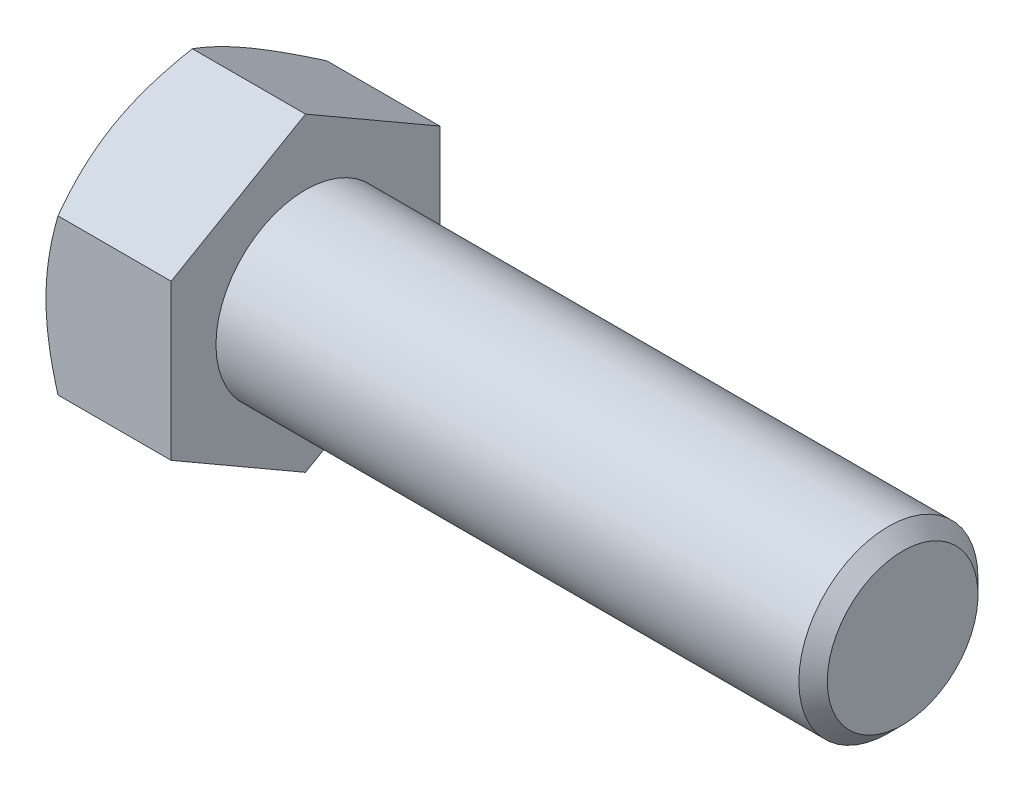
ISO-10303-21;
HEADER;
FILE_DESCRIPTION(('STEP AP214'),'2;1');
FILE_NAME('part.step','',(''),(''),'','','');
FILE_SCHEMA(('AUTOMOTIVE_DESIGN { 1 0 10303 214 1 1 1 1 }'));
ENDSEC;
DATA;
#1=APPLICATION_CONTEXT('core data for automotive mechanical design processes');
#2=APPLICATION_PROTOCOL_DEFINITION('international standard','automotive_design',2000,#1);
#3=PRODUCT_CONTEXT('',#1,'mechanical');
#4=PRODUCT('Part','Part','',(#3));
#5=PRODUCT_RELATED_PRODUCT_CATEGORY('part','',(#4));
#6=PRODUCT_DEFINITION_FORMATION('','',#4);
#7=PRODUCT_DEFINITION_CONTEXT('part definition',#1,'design');
#8=PRODUCT_DEFINITION('design','',#6,#7);
#9=PRODUCT_DEFINITION_SHAPE('','',#8);
#10=(LENGTH_UNIT() NAMED_UNIT(*) SI_UNIT(.MILLI.,.METRE.));
#11=(NAMED_UNIT(*) PLANE_ANGLE_UNIT() SI_UNIT($,.RADIAN.));
#12=(NAMED_UNIT(*) SI_UNIT($,.STERADIAN.) SOLID_ANGLE_UNIT());
#13=UNCERTAINTY_MEASURE_WITH_UNIT(LENGTH_MEASURE(1.E-05),#10,'distance_accuracy_value','');
#14=(GEOMETRIC_REPRESENTATION_CONTEXT(3) GLOBAL_UNCERTAINTY_ASSIGNED_CONTEXT((#13)) GLOBAL_UNIT_ASSIGNED_CONTEXT((#10,
#11,#12)) REPRESENTATION_CONTEXT('',''));
#15=CARTESIAN_POINT('',(0.,0.,0.));
#16=DIRECTION('',(0.,0.,1.));
#17=DIRECTION('',(1.,0.,0.));
#18=AXIS2_PLACEMENT_3D('',#15,#16,#17);
#19=CARTESIAN_POINT('',(13.3096,8.24889197104677,-14.2875));
#20=DIRECTION('',(0.,-0.866025403784438,0.5));
#21=DIRECTION('',(0.,-0.5,-0.866025403784438));
#22=AXIS2_PLACEMENT_3D('',#19,#20,#21);
#23=PLANE('',#22);
#24=CARTESIAN_POINT('',(1.2761746963198,16.4978994121474,0.000200000000000058));
#25=CARTESIAN_POINT('',(1.17150354049374,16.316591962665,-0.313833714294314));
#26=CARTESIAN_POINT('',(1.07158215537579,16.1345773166767,-0.629092328867607));
#27=CARTESIAN_POINT('',(0.882559201585307,15.7690884807822,-1.26213756223605));
#28=CARTESIAN_POINT('',(0.793461191524302,15.5856138318553,-1.5799249760784));
#29=CARTESIAN_POINT('',(0.627282646740069,15.2168504028066,-2.21864197116398));
#30=CARTESIAN_POINT('',(0.550230545696853,15.0315583957425,-2.53957714163546));
#31=CARTESIAN_POINT('',(0.409798352887989,14.6596868248225,-3.18367759635941));
#32=CARTESIAN_POINT('',(0.346417481149996,14.4731073350473,-3.50684275230036));
#33=CARTESIAN_POINT('',(0.236023554267069,14.1034416805247,-4.1471224477466));
#34=CARTESIAN_POINT('',(0.188645115273865,13.9203829601652,-4.46418945217786));
#35=CARTESIAN_POINT('',(0.109201912674412,13.5534267067704,-5.09977632721271));
#36=CARTESIAN_POINT('',(0.0771374438271074,13.3695291576584,-5.41829622566207));
#37=CARTESIAN_POINT('',(0.0291317909883727,13.0014251352584,-6.05587109492942));
#38=CARTESIAN_POINT('',(0.0131714475146423,12.8172192908535,-6.37492497648983));
#39=CARTESIAN_POINT('',(-0.00228271550063014,12.448637559964,-7.01332726113216));
#40=CARTESIAN_POINT('',(-0.0017770438382684,12.2642616789095,-7.33267565480881));
#41=CARTESIAN_POINT('',(0.0145506803037122,11.9195719861559,-7.92969571550333));
#42=CARTESIAN_POINT('',(0.0283811431962148,11.759233611051,-8.20740992758799));
#43=CARTESIAN_POINT('',(0.0682339694513744,11.4389256760858,-8.76219954501513));
#44=CARTESIAN_POINT('',(0.0942571951847598,11.2789561431174,-9.03927490377954));
#45=CARTESIAN_POINT('',(0.158041814881287,10.9594727825021,-9.59263631653807));
#46=CARTESIAN_POINT('',(0.19581290358283,10.7999594414437,-9.86892152773624));
#47=CARTESIAN_POINT('',(0.282430562472695,10.4816805882453,-10.4201966724507));
#48=CARTESIAN_POINT('',(0.33127788559734,10.3229151276936,-10.6951865166133));
#49=CARTESIAN_POINT('',(0.495669002146556,9.84097374681805,-11.5299334745597));
#50=CARTESIAN_POINT('',(0.627604309461495,9.51919345055701,-12.0872732965584));
#51=CARTESIAN_POINT('',(0.927043495545047,8.88043099732143,-13.1936423195297));
#52=CARTESIAN_POINT('',(1.09447704990011,8.56344066203607,-13.7426856857522));
#53=CARTESIAN_POINT('',(1.27617469631979,8.24877650099293,-14.2877));
#54=B_SPLINE_CURVE_WITH_KNOTS('',3,(#24,#25,#26,#27,#28,#29,#30,#31,#32,#33,#34,#35,#36,#37,#38,
#39,#40,#41,#42,#43,#44,#45,#46,#47,#48,#49,#50,#51,#52,#53),.UNSPECIFIED.,.F.,.F.,(4,2,2,2,2,2,
2,2,2,2,2,2,2,2,4),(0.,1.1322886698782,2.26494862244556,3.40024304981971,4.53547268912058,
5.64268215336774,6.74991292800918,7.85582484363027,8.96170258685889,9.92439507576008,
10.8871556643353,11.8507128733959,12.8143356024524,14.7839571212635,16.7497125507192),.UNSPECIFIED.);
#55=CARTESIAN_POINT('',(1.27610802895322,16.4977839420936,0.));
#56=VERTEX_POINT('',#55);
#57=CARTESIAN_POINT('',(0.,12.3733379565702,-7.14375));
#58=VERTEX_POINT('',#57);
#59=EDGE_CURVE('E33',#56,#58,#54,.T.);
#60=ORIENTED_EDGE('',*,*,#59,.F.);
#61=DIRECTION('',(-1.,0.,0.));
#62=VECTOR('',#61,1.);
#63=CARTESIAN_POINT('',(13.3096,16.4977839420936,0.));
#64=LINE('',#63,#62);
#65=CARTESIAN_POINT('',(13.3096,16.4977839420936,0.));
#66=VERTEX_POINT('',#65);
#67=EDGE_CURVE('E129',#66,#56,#64,.T.);
#68=ORIENTED_EDGE('',*,*,#67,.F.);
#69=DIRECTION('',(0.,0.5,0.866025403784438));
#70=VECTOR('',#69,1.);
#71=CARTESIAN_POINT('',(13.3096,8.24889197104677,-14.2875));
#72=LINE('',#71,#70);
#73=CARTESIAN_POINT('',(13.3096,8.24889197104677,-14.2875));
#74=VERTEX_POINT('',#73);
#75=EDGE_CURVE('E214',#74,#66,#72,.T.);
#76=ORIENTED_EDGE('',*,*,#75,.F.);
#77=DIRECTION('',(-1.,0.,0.));
#78=VECTOR('',#77,1.);
#79=CARTESIAN_POINT('',(13.3096,8.24889197104677,-14.2875));
#80=LINE('',#79,#78);
#81=CARTESIAN_POINT('',(1.27610802895321,8.24889197104677,-14.2875));
#82=VERTEX_POINT('',#81);
#83=EDGE_CURVE('E117',#74,#82,#80,.T.);
#84=ORIENTED_EDGE('',*,*,#83,.T.);
#85=EDGE_CURVE('E111',#58,#82,#54,.T.);
#86=ORIENTED_EDGE('',*,*,#85,.F.);
#87=EDGE_LOOP('',(#60,#68,#76,#84,#86));
#88=FACE_BOUND('',#87,.T.);
#89=ADVANCED_FACE('F17',(#88),#23,.F.);
#90=CARTESIAN_POINT('',(13.3096,16.4977839420936,0.));
#91=DIRECTION('',(0.,-0.866025403784438,-0.5));
#92=DIRECTION('',(0.,0.5,-0.866025403784438));
#93=AXIS2_PLACEMENT_3D('',#90,#91,#92);
#94=PLANE('',#93);
#95=CARTESIAN_POINT('',(1.27617469631979,8.24877650099293,14.2877));
#96=CARTESIAN_POINT('',(1.17150354049373,8.43008395047537,13.9736662857057));
#97=CARTESIAN_POINT('',(1.07158215537578,8.61209859646361,13.6584076711324));
#98=CARTESIAN_POINT('',(0.882559201585304,8.97758743235809,13.0253624377639));
#99=CARTESIAN_POINT('',(0.793461191524299,9.16106208128505,12.7075750239216));
#100=CARTESIAN_POINT('',(0.627282646740065,9.52982551033369,12.068858028836));
#101=CARTESIAN_POINT('',(0.550230545696849,9.71511751739782,11.7479228583645));
#102=CARTESIAN_POINT('',(0.409798352887985,10.0869890883179,11.1038224036406));
#103=CARTESIAN_POINT('',(0.346417481149992,10.2735685780931,10.7806572476996));
#104=CARTESIAN_POINT('',(0.236023554267066,10.6432342326156,10.1403775522534));
#105=CARTESIAN_POINT('',(0.188645115273863,10.8262929529751,9.82331054782214));
#106=CARTESIAN_POINT('',(0.109201912674409,11.1932492063699,9.18772367278729));
#107=CARTESIAN_POINT('',(0.0771374438271045,11.3771467554819,8.86920377433793));
#108=CARTESIAN_POINT('',(0.0291317909883698,11.7452507778819,8.23162890507058));
#109=CARTESIAN_POINT('',(0.0131714475146401,11.9294566222868,7.91257502351017));
#110=CARTESIAN_POINT('',(-0.00228271550063099,12.2980383531764,7.27417273886784));
#111=CARTESIAN_POINT('',(-0.00177704383826868,12.4824142342309,6.9548243451912));
#112=CARTESIAN_POINT('',(0.0145506803037115,12.8271039269845,6.35780428449668));
#113=CARTESIAN_POINT('',(0.0283811431962134,12.9874423020893,6.08009007241201));
#114=CARTESIAN_POINT('',(0.0682339694513723,13.3077502370545,5.52530045498486));
#115=CARTESIAN_POINT('',(0.0942571951847574,13.4677197700229,5.24822509622045));
#116=CARTESIAN_POINT('',(0.158041814881285,13.7872031306382,4.69486368346192));
#117=CARTESIAN_POINT('',(0.195812903582828,13.9467164716966,4.41857847226375));
#118=CARTESIAN_POINT('',(0.282430562472694,14.264995324895,3.86730332754926));
#119=CARTESIAN_POINT('',(0.331277885597339,14.4237607854467,3.59231348338673));
#120=CARTESIAN_POINT('',(0.495669002146555,14.9057021663223,2.75756652544034));
#121=CARTESIAN_POINT('',(0.627604309461494,15.2274824625833,2.20022670344164));
#122=CARTESIAN_POINT('',(0.927043495545049,15.8662449158189,1.09385768047029));
#123=CARTESIAN_POINT('',(1.09447704990012,16.1832352511043,0.544814314247752));
#124=CARTESIAN_POINT('',(1.2761746963198,16.4978994121474,-0.000200000000000018));
#125=B_SPLINE_CURVE_WITH_KNOTS('',3,(#95,#96,#97,#98,#99,#100,#101,#102,#103,#104,#105,#106,
#107,#108,#109,#110,#111,#112,#113,#114,#115,#116,#117,#118,#119,#120,#121,#122,#123,#124),
.UNSPECIFIED.,.F.,.F.,(4,2,2,2,2,2,2,2,2,2,2,2,2,2,4),(0.,1.1322886698782,2.26494862244556,
3.4002430498197,4.53547268912058,5.64268215336774,6.74991292800918,7.85582484363026,
8.96170258685889,9.92439507576008,10.8871556643353,11.8507128733959,12.8143356024524,
14.7839571212635,16.7497125507192),.UNSPECIFIED.);
#126=CARTESIAN_POINT('',(1.27610802895321,8.24889197104677,14.2875));
#127=VERTEX_POINT('',#126);
#128=CARTESIAN_POINT('',(0.,12.3733379565702,7.14375));
#129=VERTEX_POINT('',#128);
#130=EDGE_CURVE('E40',#127,#129,#125,.T.);
#131=ORIENTED_EDGE('',*,*,#130,.F.);
#132=DIRECTION('',(-1.,0.,0.));
#133=VECTOR('',#132,1.);
#134=CARTESIAN_POINT('',(13.3096,8.24889197104677,14.2875));
#135=LINE('',#134,#133);
#136=CARTESIAN_POINT('',(13.3096,8.24889197104677,14.2875));
#137=VERTEX_POINT('',#136);
#138=EDGE_CURVE('E127',#137,#127,#135,.T.);
#139=ORIENTED_EDGE('',*,*,#138,.F.);
#140=DIRECTION('',(0.,-0.5,0.866025403784438));
#141=VECTOR('',#140,1.);
#142=CARTESIAN_POINT('',(13.3096,16.4977839420936,0.));
#143=LINE('',#142,#141);
#144=EDGE_CURVE('E212',#66,#137,#143,.T.);
#145=ORIENTED_EDGE('',*,*,#144,.F.);
#146=ORIENTED_EDGE('',*,*,#67,.T.);
#147=EDGE_CURVE('E144',#129,#56,#125,.T.);
#148=ORIENTED_EDGE('',*,*,#147,.F.);
#149=EDGE_LOOP('',(#131,#139,#145,#146,#148));
#150=FACE_BOUND('',#149,.T.);
#151=ADVANCED_FACE('F150',(#150),#94,.F.);
#152=CARTESIAN_POINT('',(13.3096,8.24889197104677,14.2875));
#153=DIRECTION('',(0.,0.,-1.));
#154=DIRECTION('',(-1.,0.,0.));
#155=AXIS2_PLACEMENT_3D('',#152,#153,#154);
#156=PLANE('',#155);
#157=CARTESIAN_POINT('',(7.0855965279389,-22.3898851342873,14.2875));
#158=CARTESIAN_POINT('',(6.93326774436824,-22.0768961424988,14.2875));
#159=CARTESIAN_POINT('',(6.78168115239734,-21.7635461017204,14.2875));
#160=CARTESIAN_POINT('',(6.4801599920685,-21.1360486618526,14.2875));
#161=CARTESIAN_POINT('',(6.33022543962594,-20.8219012551173,14.2875));
#162=CARTESIAN_POINT('',(5.88311326689127,-19.8780695944246,14.2875));
#163=CARTESIAN_POINT('',(5.58867058876341,-19.2470849528527,14.2875));
#164=CARTESIAN_POINT('',(5.00727921872568,-17.9776461426616,14.2875));
#165=CARTESIAN_POINT('',(4.72037808277905,-17.3391701428622,14.2875));
#166=CARTESIAN_POINT('',(4.15800525766509,-16.0572214716097,14.2875));
#167=CARTESIAN_POINT('',(3.8825330437897,-15.4137490311598,14.2875));
#168=CARTESIAN_POINT('',(3.33703966621229,-14.0991063589254,14.2875));
#169=CARTESIAN_POINT('',(3.06751086978,-13.4277307806527,14.2875));
#170=CARTESIAN_POINT('',(2.54829414601393,-12.0772064829561,14.2875));
#171=CARTESIAN_POINT('',(2.29860841280823,-11.3980569134026,14.2875));
#172=CARTESIAN_POINT('',(1.82546713280971,-10.0321237221448,14.2875));
#173=CARTESIAN_POINT('',(1.60196042465476,-9.34535796207524,14.2875));
#174=CARTESIAN_POINT('',(1.18818152817919,-7.96191308862403,14.2875));
#175=CARTESIAN_POINT('',(0.997899114040868,-7.26523709707387,14.2875));
#176=CARTESIAN_POINT('',(0.744688974397577,-6.21459800062991,14.2875));
#177=CARTESIAN_POINT('',(0.665833592796575,-5.86445181124275,14.2875));
#178=CARTESIAN_POINT('',(0.519775761517192,-5.16172478929878,14.2875));
#179=CARTESIAN_POINT('',(0.4525730841182,-4.80914400445961,14.2875));
#180=CARTESIAN_POINT('',(0.330991997882774,-4.10177331514528,14.2875));
#181=CARTESIAN_POINT('',(0.276613366968521,-3.74698344903465,14.2875));
#182=CARTESIAN_POINT('',(0.181756259365385,-3.03555342967879,14.2875));
#183=CARTESIAN_POINT('',(0.141277164000261,-2.67891335950466,14.2875));
#184=CARTESIAN_POINT('',(0.0755436501749549,-1.96903610824525,14.2875));
#185=CARTESIAN_POINT('',(0.0500928078931712,-1.61581722831776,14.2875));
#186=CARTESIAN_POINT('',(0.0141622344815539,-0.908619534519812,14.2875));
#187=CARTESIAN_POINT('',(0.00368224838773861,-0.554640733694156,14.2875));
#188=CARTESIAN_POINT('',(-0.00205625517160147,0.153442976516876,14.2875));
#189=CARTESIAN_POINT('',(0.00268522421651992,0.507547885876169,14.2875));
#190=CARTESIAN_POINT('',(0.0272712916073624,1.21523734126377,14.2875));
#191=CARTESIAN_POINT('',(0.0471165516889169,1.5688218634347,14.2875));
#192=CARTESIAN_POINT('',(0.111996030715685,2.41165837605609,14.2875));
#193=CARTESIAN_POINT('',(0.163810406012934,2.90039810812893,14.2875));
#194=CARTESIAN_POINT('',(0.293528568861567,3.87440480088247,14.2875));
#195=CARTESIAN_POINT('',(0.371435711956984,4.35967130670226,14.2875));
#196=CARTESIAN_POINT('',(0.550568351138067,5.32621624885335,14.2875));
#197=CARTESIAN_POINT('',(0.651811305810555,5.80749141839648,14.2875));
#198=CARTESIAN_POINT('',(0.874513373152626,6.76529068218775,14.2875));
#199=CARTESIAN_POINT('',(0.995972235469242,7.24181483519484,14.2875));
#200=CARTESIAN_POINT('',(1.2590516727956,8.20075205297899,14.2875));
#201=CARTESIAN_POINT('',(1.4010638830911,8.68305692194861,14.2875));
#202=CARTESIAN_POINT('',(1.7002340326883,9.6429192871862,14.2875));
#203=CARTESIAN_POINT('',(1.85739207605541,10.1204767508104,14.2875));
#204=CARTESIAN_POINT('',(2.18431745568629,11.0710723074272,14.2875));
#205=CARTESIAN_POINT('',(2.35408093259955,11.5441117340359,14.2875));
#206=CARTESIAN_POINT('',(2.70417375019698,12.4862394619856,14.2875));
#207=CARTESIAN_POINT('',(2.88450294056085,12.9553278194306,14.2875));
#208=CARTESIAN_POINT('',(3.33642274016732,14.0985450065596,14.2875));
#209=CARTESIAN_POINT('',(3.61283070248076,14.7707670898936,14.2875));
#210=CARTESIAN_POINT('',(4.17998789133628,16.1091534029533,14.2875));
#211=CARTESIAN_POINT('',(4.47073817782473,16.7753171806279,14.2875));
#212=CARTESIAN_POINT('',(5.06358549747402,18.102774166092,14.2875));
#213=CARTESIAN_POINT('',(5.36568552319722,18.7640660335556,14.2875));
#214=CARTESIAN_POINT('',(5.97884037834035,20.0824528232488,14.2875));
#215=CARTESIAN_POINT('',(6.28989497543738,20.7395478538242,14.2875));
#216=CARTESIAN_POINT('',(6.91960732305529,22.0510812884522,14.2875));
#217=CARTESIAN_POINT('',(7.23827402641683,22.7055153859258,14.2875));
#218=CARTESIAN_POINT('',(7.88149355740303,24.0114843944654,14.2875));
#219=CARTESIAN_POINT('',(8.20604641583509,24.6630192903352,14.2875));
#220=CARTESIAN_POINT('',(8.85994319558249,25.9635553563957,14.2875));
#221=CARTESIAN_POINT('',(9.18928639131475,26.6125568918044,14.2875));
#222=CARTESIAN_POINT('',(9.85199752466459,27.908497827111,14.2875));
#223=CARTESIAN_POINT('',(10.1853654534043,28.5554372315537,14.2875));
#224=CARTESIAN_POINT('',(11.1306522650553,30.3782153796345,14.2875));
#225=CARTESIAN_POINT('',(11.7464658040006,31.552034221779,14.2875));
#226=CARTESIAN_POINT('',(12.986363746465,33.8953480167575,14.2875));
#227=CARTESIAN_POINT('',(13.6104484964428,35.0648427858266,14.2875));
#228=CARTESIAN_POINT('',(14.8631697815114,37.3972192158521,14.2875));
#229=CARTESIAN_POINT('',(15.4917889301423,38.5601102215233,14.2875));
#230=CARTESIAN_POINT('',(16.4383496267994,40.3024250254984,14.2875));
#231=CARTESIAN_POINT('',(16.7544655486287,40.8828421091005,14.2875));
#232=CARTESIAN_POINT('',(17.3877853905544,42.0430813004766,14.2875));
#233=CARTESIAN_POINT('',(17.7049893090019,42.6229034091506,14.2875));
#234=CARTESIAN_POINT('',(18.0226732603816,43.2024624631236,14.2875));
#235=B_SPLINE_CURVE_WITH_KNOTS('',3,(#157,#158,#159,#160,#161,#162,#163,#164,#165,#166,#167,
#168,#169,#170,#171,#172,#173,#174,#175,#176,#177,#178,#179,#180,#181,#182,#183,#184,#185,#186,
#187,#188,#189,#190,#191,#192,#193,#194,#195,#196,#197,#198,#199,#200,#201,#202,#203,#204,#205,
#206,#207,#208,#209,#210,#211,#212,#213,#214,#215,#216,#217,#218,#219,#220,#221,#222,#223,#224,
#225,#226,#227,#228,#229,#230,#231,#232,#233,#234),.UNSPECIFIED.,.F.,.F.,(4,2,2,2,2,2,2,2,2,2,2,
2,2,2,2,2,2,2,2,2,2,2,2,2,2,2,2,2,2,2,2,2,2,2,2,2,2,2,4),(0.,1.0442661099103,2.08854227127865,
4.17739185010566,6.27722701720196,8.37696567279867,10.5470989913266,12.7174719374014,
14.8835299631499,17.0489201369704,18.1255049226402,19.2020686669982,20.278613766813,
21.3551109427791,22.4172072972407,23.479285563255,24.5413636097324,25.6034889186751,
27.0771146642289,28.5509299916624,30.0258515473473,31.5007548390233,33.0087918141127,
34.5168391515032,36.0244266654306,37.531992735848,39.7122554064864,41.8926794480338,
44.0736824888245,46.2546289952362,48.4382808994405,50.621944235906,52.805280192083,
54.9886113331132,58.9652043914674,62.9419645483717,66.907714305988,68.8904689585312,
70.8732206074406),.UNSPECIFIED.);
#236=CARTESIAN_POINT('',(1.27610802895322,-8.24889197104679,14.2875));
#237=VERTEX_POINT('',#236);
#238=CARTESIAN_POINT('',(0.,0.,14.2875));
#239=VERTEX_POINT('',#238);
#240=EDGE_CURVE('E224',#237,#239,#235,.T.);
#241=ORIENTED_EDGE('',*,*,#240,.F.);
#242=DIRECTION('',(-1.,0.,0.));
#243=VECTOR('',#242,1.);
#244=CARTESIAN_POINT('',(13.3096,-8.24889197104679,14.2875));
#245=LINE('',#244,#243);
#246=CARTESIAN_POINT('',(13.3096,-8.24889197104679,14.2875));
#247=VERTEX_POINT('',#246);
#248=EDGE_CURVE('E119',#247,#237,#245,.T.);
#249=ORIENTED_EDGE('',*,*,#248,.F.);
#250=DIRECTION('',(0.,-1.,0.));
#251=VECTOR('',#250,1.);
#252=CARTESIAN_POINT('',(13.3096,8.24889197104677,14.2875));
#253=LINE('',#252,#251);
#254=EDGE_CURVE('E208',#137,#247,#253,.T.);
#255=ORIENTED_EDGE('',*,*,#254,.F.);
#256=ORIENTED_EDGE('',*,*,#138,.T.);
#257=EDGE_CURVE('E166',#239,#127,#235,.T.);
#258=ORIENTED_EDGE('',*,*,#257,.F.);
#259=EDGE_LOOP('',(#241,#249,#255,#256,#258));
#260=FACE_BOUND('',#259,.T.);
#261=ADVANCED_FACE('F230',(#260),#156,.F.);
#262=CARTESIAN_POINT('',(13.3096,-16.4977839420936,0.));
#263=DIRECTION('',(0.,0.866025403784438,-0.5));
#264=DIRECTION('',(0.,0.5,0.866025403784438));
#265=AXIS2_PLACEMENT_3D('',#262,#263,#264);
#266=PLANE('',#265);
#267=CARTESIAN_POINT('',(1.27617469631981,-16.4978994121474,-0.000199999999999685));
#268=CARTESIAN_POINT('',(1.17150354049376,-16.316591962665,0.313833714294316));
#269=CARTESIAN_POINT('',(1.07158215537581,-16.1345773166768,0.62909232886761));
#270=CARTESIAN_POINT('',(0.882559201585332,-15.7690884807823,1.26213756223605));
#271=CARTESIAN_POINT('',(0.793461191524326,-15.5856138318553,1.57992497607841));
#272=CARTESIAN_POINT('',(0.627282646740092,-15.2168504028067,2.21864197116398));
#273=CARTESIAN_POINT('',(0.550230545696877,-15.0315583957425,2.53957714163546));
#274=CARTESIAN_POINT('',(0.409798352888012,-14.6596868248225,3.18367759635942));
#275=CARTESIAN_POINT('',(0.346417481150019,-14.4731073350473,3.50684275230037));
#276=CARTESIAN_POINT('',(0.236023554267092,-14.1034416805248,4.14712244774661));
#277=CARTESIAN_POINT('',(0.188645115273888,-13.9203829601652,4.46418945217787));
#278=CARTESIAN_POINT('',(0.109201912674435,-13.5534267067705,5.09977632721272));
#279=CARTESIAN_POINT('',(0.0771374438271291,-13.3695291576585,5.41829622566208));
#280=CARTESIAN_POINT('',(0.0291317909883959,-13.0014251352584,6.05587109492944));
#281=CARTESIAN_POINT('',(0.0131714475146683,-12.8172192908535,6.37492497648985));
#282=CARTESIAN_POINT('',(-0.00228271550061165,-12.448637559964,7.01332726113217));
#283=CARTESIAN_POINT('',(-0.00177704383826042,-12.2642616789095,7.33267565480882));
#284=CARTESIAN_POINT('',(0.0145506803037216,-11.9195719861559,7.92969571550334));
#285=CARTESIAN_POINT('',(0.0283811431962334,-11.759233611051,8.20740992758801));
#286=CARTESIAN_POINT('',(0.0682339694513997,-11.4389256760859,8.76219954501515));
#287=CARTESIAN_POINT('',(0.0942571951847823,-11.2789561431174,9.03927490377956));
#288=CARTESIAN_POINT('',(0.158041814881307,-10.9594727825022,9.59263631653809));
#289=CARTESIAN_POINT('',(0.19581290358285,-10.7999594414438,9.86892152773625));
#290=CARTESIAN_POINT('',(0.282430562472715,-10.4816805882453,10.4201966724507));
#291=CARTESIAN_POINT('',(0.33127788559736,-10.3229151276937,10.6951865166133));
#292=CARTESIAN_POINT('',(0.495669002146576,-9.84097374681809,11.5299334745597));
#293=CARTESIAN_POINT('',(0.627604309461515,-9.51919345055705,12.0872732965584));
#294=CARTESIAN_POINT('',(0.927043495545063,-8.88043099732147,13.1936423195297));
#295=CARTESIAN_POINT('',(1.09447704990012,-8.56344066203611,13.7426856857523));
#296=CARTESIAN_POINT('',(1.27617469631979,-8.24877650099295,14.2877));
#297=B_SPLINE_CURVE_WITH_KNOTS('',3,(#267,#268,#269,#270,#271,#272,#273,#274,#275,#276,#277,
#278,#279,#280,#281,#282,#283,#284,#285,#286,#287,#288,#289,#290,#291,#292,#293,#294,#295,#296),
.UNSPECIFIED.,.F.,.F.,(4,2,2,2,2,2,2,2,2,2,2,2,2,2,4),(0.,1.13228866987821,2.26494862244556,
3.40024304981971,4.53547268912059,5.64268215336776,6.74991292800919,7.85582484363028,
8.96170258685891,9.9243950757601,10.8871556643353,11.850712873396,12.8143356024524,
14.7839571212636,16.7497125507192),.UNSPECIFIED.);
#298=CARTESIAN_POINT('',(1.27610802895323,-16.4977839420936,0.));
#299=VERTEX_POINT('',#298);
#300=CARTESIAN_POINT('',(0.,-12.3733379565702,7.14375));
#301=VERTEX_POINT('',#300);
#302=EDGE_CURVE('E152',#299,#301,#297,.T.);
#303=ORIENTED_EDGE('',*,*,#302,.F.);
#304=DIRECTION('',(-1.,0.,0.));
#305=VECTOR('',#304,1.);
#306=CARTESIAN_POINT('',(13.3096,-16.4977839420936,0.));
#307=LINE('',#306,#305);
#308=CARTESIAN_POINT('',(13.3096,-16.4977839420936,0.));
#309=VERTEX_POINT('',#308);
#310=EDGE_CURVE('E116',#309,#299,#307,.T.);
#311=ORIENTED_EDGE('',*,*,#310,.F.);
#312=DIRECTION('',(0.,-0.5,-0.866025403784438));
#313=VECTOR('',#312,1.);
#314=CARTESIAN_POINT('',(13.3096,-16.4977839420936,0.));
#315=LINE('',#314,#313);
#316=EDGE_CURVE('E206',#247,#309,#315,.T.);
#317=ORIENTED_EDGE('',*,*,#316,.F.);
#318=ORIENTED_EDGE('',*,*,#248,.T.);
#319=EDGE_CURVE('E154',#301,#237,#297,.T.);
#320=ORIENTED_EDGE('',*,*,#319,.F.);
#321=EDGE_LOOP('',(#303,#311,#317,#318,#320));
#322=FACE_BOUND('',#321,.T.);
#323=ADVANCED_FACE('F202',(#322),#266,.F.);
#324=CARTESIAN_POINT('',(13.3096,-8.2488919710468,-14.2875));
#325=DIRECTION('',(0.,0.866025403784438,0.5));
#326=DIRECTION('',(0.,-0.5,0.866025403784438));
#327=AXIS2_PLACEMENT_3D('',#324,#325,#326);
#328=PLANE('',#327);
#329=CARTESIAN_POINT('',(1.27617469631979,-8.24877650099296,-14.2877));
#330=CARTESIAN_POINT('',(1.17150354049374,-8.4300839504754,-13.9736662857057));
#331=CARTESIAN_POINT('',(1.07158215537579,-8.61209859646364,-13.6584076711324));
#332=CARTESIAN_POINT('',(0.882559201585316,-8.97758743235812,-13.0253624377639));
#333=CARTESIAN_POINT('',(0.793461191524311,-9.16106208128508,-12.7075750239216));
#334=CARTESIAN_POINT('',(0.627282646740076,-9.52982551033373,-12.068858028836));
#335=CARTESIAN_POINT('',(0.550230545696861,-9.71511751739785,-11.7479228583645));
#336=CARTESIAN_POINT('',(0.409798352887998,-10.0869890883179,-11.1038224036406));
#337=CARTESIAN_POINT('',(0.346417481150005,-10.2735685780931,-10.7806572476996));
#338=CARTESIAN_POINT('',(0.23602355426708,-10.6432342326156,-10.1403775522534));
#339=CARTESIAN_POINT('',(0.188645115273877,-10.8262929529752,-9.82331054782214));
#340=CARTESIAN_POINT('',(0.109201912674424,-11.1932492063699,-9.18772367278729));
#341=CARTESIAN_POINT('',(0.0771374438271197,-11.3771467554819,-8.86920377433793));
#342=CARTESIAN_POINT('',(0.0291317909883864,-11.745250777882,-8.23162890507058));
#343=CARTESIAN_POINT('',(0.0131714475146576,-11.9294566222869,-7.91257502351017));
#344=CARTESIAN_POINT('',(-0.0022827155006155,-12.2980383531764,-7.27417273886784));
#345=CARTESIAN_POINT('',(-0.00177704383825612,-12.4824142342309,-6.95482434519119));
#346=CARTESIAN_POINT('',(0.0145506803037254,-12.8271039269845,-6.35780428449667));
#347=CARTESIAN_POINT('',(0.0283811431962306,-12.9874423020893,-6.080090072412));
#348=CARTESIAN_POINT('',(0.0682339694513925,-13.3077502370545,-5.52530045498486));
#349=CARTESIAN_POINT('',(0.0942571951847772,-13.467719770023,-5.24822509622045));
#350=CARTESIAN_POINT('',(0.158041814881305,-13.7872031306382,-4.69486368346192));
#351=CARTESIAN_POINT('',(0.195812903582848,-13.9467164716966,-4.41857847226375));
#352=CARTESIAN_POINT('',(0.282430562472714,-14.2649953248951,-3.86730332754925));
#353=CARTESIAN_POINT('',(0.331277885597359,-14.4237607854467,-3.59231348338673));
#354=CARTESIAN_POINT('',(0.495669002146577,-14.9057021663223,-2.75756652544034));
#355=CARTESIAN_POINT('',(0.627604309461517,-15.2274824625834,-2.20022670344163));
#356=CARTESIAN_POINT('',(0.92704349554507,-15.8662449158189,-1.09385768047029));
#357=CARTESIAN_POINT('',(1.09447704990014,-16.1832352511043,-0.544814314247749));
#358=CARTESIAN_POINT('',(1.27617469631981,-16.4978994121474,0.000200000000003083));
#359=B_SPLINE_CURVE_WITH_KNOTS('',3,(#329,#330,#331,#332,#333,#334,#335,#336,#337,#338,#339,
#340,#341,#342,#343,#344,#345,#346,#347,#348,#349,#350,#351,#352,#353,#354,#355,#356,#357,#358),
.UNSPECIFIED.,.F.,.F.,(4,2,2,2,2,2,2,2,2,2,2,2,2,2,4),(0.,1.1322886698782,2.26494862244556,
3.4002430498197,4.53547268912058,5.64268215336774,6.74991292800917,7.85582484363026,
8.96170258685889,9.92439507576008,10.8871556643353,11.8507128733959,12.8143356024524,
14.7839571212635,16.7497125507192),.UNSPECIFIED.);
#360=CARTESIAN_POINT('',(1.27610802895322,-8.2488919710468,-14.2875));
#361=VERTEX_POINT('',#360);
#362=CARTESIAN_POINT('',(0.,-12.3733379565702,-7.14375));
#363=VERTEX_POINT('',#362);
#364=EDGE_CURVE('E93',#361,#363,#359,.T.);
#365=ORIENTED_EDGE('',*,*,#364,.F.);
#366=DIRECTION('',(-1.,0.,0.));
#367=VECTOR('',#366,1.);
#368=CARTESIAN_POINT('',(13.3096,-8.2488919710468,-14.2875));
#369=LINE('',#368,#367);
#370=CARTESIAN_POINT('',(13.3096,-8.2488919710468,-14.2875));
#371=VERTEX_POINT('',#370);
#372=EDGE_CURVE('E107',#371,#361,#369,.T.);
#373=ORIENTED_EDGE('',*,*,#372,.F.);
#374=DIRECTION('',(0.,0.5,-0.866025403784438));
#375=VECTOR('',#374,1.);
#376=CARTESIAN_POINT('',(13.3096,-8.2488919710468,-14.2875));
#377=LINE('',#376,#375);
#378=EDGE_CURVE('E204',#309,#371,#377,.T.);
#379=ORIENTED_EDGE('',*,*,#378,.F.);
#380=ORIENTED_EDGE('',*,*,#310,.T.);
#381=EDGE_CURVE('E110',#363,#299,#359,.T.);
#382=ORIENTED_EDGE('',*,*,#381,.F.);
#383=EDGE_LOOP('',(#365,#373,#379,#380,#382));
#384=FACE_BOUND('',#383,.T.);
#385=ADVANCED_FACE('F105',(#384),#328,.F.);
#386=CARTESIAN_POINT('',(13.3096,8.24889197104677,-14.2875));
#387=DIRECTION('',(0.,0.,1.));
#388=DIRECTION('',(0.,-1.,0.));
#389=AXIS2_PLACEMENT_3D('',#386,#387,#388);
#390=PLANE('',#389);
#391=CARTESIAN_POINT('',(7.08559653091287,-22.3898851403977,-14.2875));
#392=CARTESIAN_POINT('',(6.93326774728018,-22.0768961485065,-14.2875));
#393=CARTESIAN_POINT('',(6.78168115524728,-21.7635461076253,-14.2875));
#394=CARTESIAN_POINT('',(6.48015999479454,-21.1360486675519,-14.2875));
#395=CARTESIAN_POINT('',(6.3302254422901,-20.8219012607137,-14.2875));
#396=CARTESIAN_POINT('',(5.88311326936994,-19.8780695997121,-14.2875));
#397=CARTESIAN_POINT('',(5.58867059111872,-19.247084957934,-14.2875));
#398=CARTESIAN_POINT('',(5.00727922083418,-17.9776461473273,-14.2875));
#399=CARTESIAN_POINT('',(4.72037808476414,-17.3391701473184,-14.2875));
#400=CARTESIAN_POINT('',(4.15800525940538,-16.0572214756457,-14.2875));
#401=CARTESIAN_POINT('',(3.88253304540861,-15.4137490349849,-14.2875));
#402=CARTESIAN_POINT('',(3.33703966758481,-14.0991063623123,-14.2875));
#403=CARTESIAN_POINT('',(3.06751087102779,-13.427730783812,-14.2875));
#404=CARTESIAN_POINT('',(2.54829414701892,-12.0772064856565,-14.2875));
#405=CARTESIAN_POINT('',(2.29860841369515,-11.3980569158718,-14.2875));
#406=CARTESIAN_POINT('',(1.82546713347176,-10.0321237241472,-14.2875));
#407=CARTESIAN_POINT('',(1.60196042520998,-9.34535796384217,-14.2875));
#408=CARTESIAN_POINT('',(1.18818152853815,-7.96191308991347,-14.2875));
#409=CARTESIAN_POINT('',(0.997899114310374,-7.26523709812134,-14.2875));
#410=CARTESIAN_POINT('',(0.744688974538729,-6.21459800125072,-14.2875));
#411=CARTESIAN_POINT('',(0.665833592890657,-5.86445181168125,-14.2875));
#412=CARTESIAN_POINT('',(0.519775761529071,-5.16172478937007,-14.2875));
#413=CARTESIAN_POINT('',(0.452573084094943,-4.809144004346,-14.2875));
#414=CARTESIAN_POINT('',(0.330991997803059,-4.1017733146598,-14.2875));
#415=CARTESIAN_POINT('',(0.276613366867474,-3.74698344836222,-14.2875));
#416=CARTESIAN_POINT('',(0.181756259237052,-3.03555342863086,-14.2875));
#417=CARTESIAN_POINT('',(0.141277163865972,-2.67891335826818,-14.2875));
#418=CARTESIAN_POINT('',(0.0755436500454331,-1.96903610663563,-14.2875));
#419=CARTESIAN_POINT('',(0.0500928077740674,-1.61581722652355,-14.2875));
#420=CARTESIAN_POINT('',(0.0141622343996004,-0.908619532356787,-14.2875));
#421=CARTESIAN_POINT('',(0.00368224833251733,-0.5546407313469,-14.2875));
#422=CARTESIAN_POINT('',(-0.00205625515740728,0.15344297923124,-14.2875));
#423=CARTESIAN_POINT('',(0.00268522427340095,0.507547888773411,-14.2875));
#424=CARTESIAN_POINT('',(0.0272712917644386,1.21523734452436,-14.2875));
#425=CARTESIAN_POINT('',(0.0471165519035016,1.56882186687576,-14.2875));
#426=CARTESIAN_POINT('',(0.111996031071712,2.4116583797756,-14.2875));
#427=CARTESIAN_POINT('',(0.163810406450369,2.90039811194562,-14.2875));
#428=CARTESIAN_POINT('',(0.293528569466127,3.87440480488909,-14.2875));
#429=CARTESIAN_POINT('',(0.371435712647262,4.35967131080165,-14.2875));
#430=CARTESIAN_POINT('',(0.55056835200112,5.32621625313482,-14.2875));
#431=CARTESIAN_POINT('',(0.651811306760672,5.80749142276727,-14.2875));
#432=CARTESIAN_POINT('',(0.874513374276013,6.76529068673457,-14.2875));
#433=CARTESIAN_POINT('',(0.995972236678834,7.24181483982836,-14.2875));
#434=CARTESIAN_POINT('',(1.25905167417799,8.20075205778828,-14.2875));
#435=CARTESIAN_POINT('',(1.40106388456012,8.6830569268469,-14.2875));
#436=CARTESIAN_POINT('',(1.70023403432786,9.64291929226152,-14.2875));
#437=CARTESIAN_POINT('',(1.8573920777789,10.1204767559737,-14.2875));
#438=CARTESIAN_POINT('',(2.18431745757464,11.071072312766,-14.2875));
#439=CARTESIAN_POINT('',(2.35408093456883,11.544111739462,-14.2875));
#440=CARTESIAN_POINT('',(2.70417375232529,12.4862394675865,-14.2875));
#441=CARTESIAN_POINT('',(2.88450294276728,12.9553278251189,-14.2875));
#442=CARTESIAN_POINT('',(3.33642274249974,14.0985450123052,-14.2875));
#443=CARTESIAN_POINT('',(3.61283070485535,14.770767095611,-14.2875));
#444=CARTESIAN_POINT('',(4.1799878937848,16.1091534086177,-14.2875));
#445=CARTESIAN_POINT('',(4.47073818030501,16.7753171862674,-14.2875));
#446=CARTESIAN_POINT('',(5.06358550000993,18.1027741716843,-14.2875));
#447=CARTESIAN_POINT('',(5.36568552575699,18.7640660391256,-14.2875));
#448=CARTESIAN_POINT('',(5.97884038094199,20.0824528287766,-14.2875));
#449=CARTESIAN_POINT('',(6.28989497805702,20.7395478593321,-14.2875));
#450=CARTESIAN_POINT('',(6.91960732570603,22.0510812939212,-14.2875));
#451=CARTESIAN_POINT('',(7.23827402908065,22.7055153913756,-14.2875));
#452=CARTESIAN_POINT('',(7.88149356008954,24.0114843998787,-14.2875));
#453=CARTESIAN_POINT('',(8.20604641853122,24.663019295731,-14.2875));
#454=CARTESIAN_POINT('',(8.85994319829524,25.9635553617577,-14.2875));
#455=CARTESIAN_POINT('',(9.18928639403452,26.6125568971502,-14.2875));
#456=CARTESIAN_POINT('',(9.85199752739625,27.9084978324256,-14.2875));
#457=CARTESIAN_POINT('',(10.1853654561409,28.555437236853,-14.2875));
#458=CARTESIAN_POINT('',(11.1306522678145,30.3782153849138,-14.2875));
#459=CARTESIAN_POINT('',(11.7464658067759,31.5520342270543,-14.2875));
#460=CARTESIAN_POINT('',(12.9863637492688,33.8953480220264,-14.2875));
#461=CARTESIAN_POINT('',(13.6104484992592,35.0648427910931,-14.2875));
#462=CARTESIAN_POINT('',(14.8631697843525,37.3972192211192,-14.2875));
#463=CARTESIAN_POINT('',(15.4917889329957,38.5601102267932,-14.2875));
#464=CARTESIAN_POINT('',(16.4383496296699,40.3024250307733,-14.2875));
#465=CARTESIAN_POINT('',(16.7544655515047,40.8828421143772,-14.2875));
#466=CARTESIAN_POINT('',(17.3877853934411,42.0430813057572,-14.2875));
#467=CARTESIAN_POINT('',(17.7049893118938,42.6229034144332,-14.2875));
#468=CARTESIAN_POINT('',(18.0226732632784,43.2024624684083,-14.2875));
#469=B_SPLINE_CURVE_WITH_KNOTS('',3,(#391,#392,#393,#394,#395,#396,#397,#398,#399,#400,#401,
#402,#403,#404,#405,#406,#407,#408,#409,#410,#411,#412,#413,#414,#415,#416,#417,#418,#419,#420,
#421,#422,#423,#424,#425,#426,#427,#428,#429,#430,#431,#432,#433,#434,#435,#436,#437,#438,#439,
#440,#441,#442,#443,#444,#445,#446,#447,#448,#449,#450,#451,#452,#453,#454,#455,#456,#457,#458,
#459,#460,#461,#462,#463,#464,#465,#466,#467,#468),.UNSPECIFIED.,.F.,.F.,(4,2,2,2,2,2,2,2,2,2,2,
2,2,2,2,2,2,2,2,2,2,2,2,2,2,2,2,2,2,2,2,2,2,2,2,2,2,2,4),(0.,1.04426611026885,2.08854227199574,
4.17739185153995,6.27722701936104,8.37696567568249,10.5470989949833,12.7174719418313,
14.8835299683505,17.048920142941,18.1255049291752,19.2020686740974,20.2786137744759,
21.3551109510055,22.4172073060168,23.4792855725806,24.5413636196078,25.6034889291003,
27.0771146749695,28.5509300027186,30.0258515587195,31.5007548507116,33.0087918261307,
34.5168391638508,36.024426678107,37.5319927488533,39.7122554194619,41.8926794609792,
44.073682501739,46.2546290081198,48.4382809122899,50.6219442487212,52.8052802048645,
54.9886113458609,58.9652044042269,62.9419645611426,66.9077143187839,68.8904689713398,
70.8732206202619),.UNSPECIFIED.);
#470=CARTESIAN_POINT('',(0.,0.,-14.2875));
#471=VERTEX_POINT('',#470);
#472=EDGE_CURVE('E99',#82,#471,#469,.F.);
#473=ORIENTED_EDGE('',*,*,#472,.F.);
#474=ORIENTED_EDGE('',*,*,#83,.F.);
#475=DIRECTION('',(0.,1.,0.));
#476=VECTOR('',#475,1.);
#477=CARTESIAN_POINT('',(13.3096,8.24889197104677,-14.2875));
#478=LINE('',#477,#476);
#479=EDGE_CURVE('E115',#371,#74,#478,.T.);
#480=ORIENTED_EDGE('',*,*,#479,.F.);
#481=ORIENTED_EDGE('',*,*,#372,.T.);
#482=EDGE_CURVE('E90',#471,#361,#469,.F.);
#483=ORIENTED_EDGE('',*,*,#482,.F.);
#484=EDGE_LOOP('',(#473,#474,#480,#481,#483));
#485=FACE_BOUND('',#484,.T.);
#486=ADVANCED_FACE('F113',(#485),#390,.F.);
#487=CARTESIAN_POINT('',(13.3096,16.4977839420936,0.));
#488=DIRECTION('',(1.,0.,0.));
#489=DIRECTION('',(0.,0.,-1.));
#490=AXIS2_PLACEMENT_3D('',#487,#488,#489);
#491=PLANE('',#490);
#492=ORIENTED_EDGE('',*,*,#75,.T.);
#493=ORIENTED_EDGE('',*,*,#144,.T.);
#494=ORIENTED_EDGE('',*,*,#254,.T.);
#495=ORIENTED_EDGE('',*,*,#316,.T.);
#496=ORIENTED_EDGE('',*,*,#378,.T.);
#497=ORIENTED_EDGE('',*,*,#479,.T.);
#498=EDGE_LOOP('',(#492,#493,#494,#495,#496,#497));
#499=FACE_BOUND('',#498,.T.);
#500=CARTESIAN_POINT('',(13.3096,0.,0.));
#501=DIRECTION('',(1.,0.,0.));
#502=DIRECTION('',(0.,0.,-1.));
#503=AXIS2_PLACEMENT_3D('',#500,#501,#502);
#504=CIRCLE('',#503,9.525);
#505=CARTESIAN_POINT('',(13.3096,0.,-9.525));
#506=VERTEX_POINT('',#505);
#507=EDGE_CURVE('E217',#506,#506,#504,.F.);
#508=ORIENTED_EDGE('',*,*,#507,.T.);
#509=EDGE_LOOP('',(#508));
#510=FACE_BOUND('',#509,.T.);
#511=ADVANCED_FACE('F232',(#499,#510),#491,.T.);
#512=CARTESIAN_POINT('',(0.,0.,0.));
#513=DIRECTION('',(-1.,0.,0.));
#514=DIRECTION('',(0.,0.,1.));
#515=AXIS2_PLACEMENT_3D('',#512,#513,#514);
#516=CYLINDRICAL_SURFACE('',#515,9.525);
#517=ORIENTED_EDGE('',*,*,#507,.F.);
#518=EDGE_LOOP('',(#517));
#519=FACE_BOUND('',#518,.T.);
#520=CARTESIAN_POINT('',(75.29703,0.,0.));
#521=DIRECTION('',(-1.,0.,0.));
#522=DIRECTION('',(0.,0.,1.));
#523=AXIS2_PLACEMENT_3D('',#520,#521,#522);
#524=CIRCLE('',#523,9.525);
#525=CARTESIAN_POINT('',(75.29703,0.,9.525));
#526=VERTEX_POINT('',#525);
#527=EDGE_CURVE('E220',#526,#526,#524,.T.);
#528=ORIENTED_EDGE('',*,*,#527,.T.);
#529=EDGE_LOOP('',(#528));
#530=FACE_BOUND('',#529,.T.);
#531=ADVANCED_FACE('F269',(#519,#530),#516,.T.);
#532=CARTESIAN_POINT('',(76.8096,0.,0.));
#533=DIRECTION('',(-1.,0.,0.));
#534=DIRECTION('',(0.,0.,1.));
#535=AXIS2_PLACEMENT_3D('',#532,#533,#534);
#536=CONICAL_SURFACE('',#535,8.01243,0.785398163397443);
#537=ORIENTED_EDGE('',*,*,#527,.F.);
#538=EDGE_LOOP('',(#537));
#539=FACE_BOUND('',#538,.T.);
#540=CARTESIAN_POINT('',(76.8096,0.,0.));
#541=DIRECTION('',(-1.,0.,0.));
#542=DIRECTION('',(0.,0.,1.));
#543=AXIS2_PLACEMENT_3D('',#540,#541,#542);
#544=CIRCLE('',#543,8.01243);
#545=CARTESIAN_POINT('',(76.8096,0.,8.01243));
#546=VERTEX_POINT('',#545);
#547=EDGE_CURVE('E222',#546,#546,#544,.T.);
#548=ORIENTED_EDGE('',*,*,#547,.T.);
#549=EDGE_LOOP('',(#548));
#550=FACE_BOUND('',#549,.T.);
#551=ADVANCED_FACE('F271',(#539,#550),#536,.T.);
#552=CARTESIAN_POINT('',(76.8096,0.,0.));
#553=DIRECTION('',(-1.,0.,0.));
#554=DIRECTION('',(0.,0.,1.));
#555=AXIS2_PLACEMENT_3D('',#552,#553,#554);
#556=PLANE('',#555);
#557=ORIENTED_EDGE('',*,*,#547,.F.);
#558=EDGE_LOOP('',(#557));
#559=FACE_BOUND('',#558,.T.);
#560=ADVANCED_FACE('F179',(#559),#556,.F.);
#561=CARTESIAN_POINT('',(0.,0.,0.));
#562=DIRECTION('',(1.,0.,0.));
#563=DIRECTION('',(0.,0.,-1.));
#564=AXIS2_PLACEMENT_3D('',#561,#562,#563);
#565=CONICAL_SURFACE('',#564,14.2875,1.0471975511966);
#566=ORIENTED_EDGE('',*,*,#364,.T.);
#567=CARTESIAN_POINT('',(0.,0.,0.));
#568=DIRECTION('',(1.,0.,0.));
#569=DIRECTION('',(0.,0.,-1.));
#570=AXIS2_PLACEMENT_3D('',#567,#568,#569);
#571=CIRCLE('',#570,14.2875);
#572=EDGE_CURVE('E21',#363,#471,#571,.T.);
#573=ORIENTED_EDGE('',*,*,#572,.T.);
#574=ORIENTED_EDGE('',*,*,#482,.T.);
#575=EDGE_LOOP('',(#566,#573,#574));
#576=FACE_BOUND('',#575,.T.);
#577=ADVANCED_FACE('F92',(#576),#565,.T.);
#578=ORIENTED_EDGE('',*,*,#302,.T.);
#579=EDGE_CURVE('E134',#301,#363,#571,.T.);
#580=ORIENTED_EDGE('',*,*,#579,.T.);
#581=ORIENTED_EDGE('',*,*,#381,.T.);
#582=EDGE_LOOP('',(#578,#580,#581));
#583=FACE_BOUND('',#582,.T.);
#584=ADVANCED_FACE('F178',(#583),#565,.T.);
#585=ORIENTED_EDGE('',*,*,#240,.T.);
#586=EDGE_CURVE('E135',#239,#301,#571,.T.);
#587=ORIENTED_EDGE('',*,*,#586,.T.);
#588=ORIENTED_EDGE('',*,*,#319,.T.);
#589=EDGE_LOOP('',(#585,#587,#588));
#590=FACE_BOUND('',#589,.T.);
#591=ADVANCED_FACE('F173',(#590),#565,.T.);
#592=ORIENTED_EDGE('',*,*,#257,.T.);
#593=ORIENTED_EDGE('',*,*,#130,.T.);
#594=CARTESIAN_POINT('',(0.,0.,0.));
#595=DIRECTION('',(-1.,0.,0.));
#596=DIRECTION('',(0.,0.,1.));
#597=AXIS2_PLACEMENT_3D('',#594,#595,#596);
#598=CIRCLE('',#597,14.2875);
#599=EDGE_CURVE('E100',#239,#129,#598,.T.);
#600=ORIENTED_EDGE('',*,*,#599,.F.);
#601=EDGE_LOOP('',(#592,#593,#600));
#602=FACE_BOUND('',#601,.T.);
#603=ADVANCED_FACE('F177',(#602),#565,.T.);
#604=ORIENTED_EDGE('',*,*,#147,.T.);
#605=ORIENTED_EDGE('',*,*,#59,.T.);
#606=EDGE_CURVE('E26',#58,#129,#571,.T.);
#607=ORIENTED_EDGE('',*,*,#606,.T.);
#608=EDGE_LOOP('',(#604,#605,#607));
#609=FACE_BOUND('',#608,.T.);
#610=ADVANCED_FACE('F143',(#609),#565,.T.);
#611=ORIENTED_EDGE('',*,*,#85,.T.);
#612=ORIENTED_EDGE('',*,*,#472,.T.);
#613=EDGE_CURVE('E11',#471,#58,#571,.T.);
#614=ORIENTED_EDGE('',*,*,#613,.T.);
#615=EDGE_LOOP('',(#611,#612,#614));
#616=FACE_BOUND('',#615,.T.);
#617=ADVANCED_FACE('F236',(#616),#565,.T.);
#618=CARTESIAN_POINT('',(0.,16.4977839420936,0.));
#619=DIRECTION('',(1.,0.,0.));
#620=DIRECTION('',(0.,0.,-1.));
#621=AXIS2_PLACEMENT_3D('',#618,#619,#620);
#622=PLANE('',#621);
#623=ORIENTED_EDGE('',*,*,#613,.F.);
#624=ORIENTED_EDGE('',*,*,#572,.F.);
#625=ORIENTED_EDGE('',*,*,#579,.F.);
#626=ORIENTED_EDGE('',*,*,#586,.F.);
#627=ORIENTED_EDGE('',*,*,#599,.T.);
#628=ORIENTED_EDGE('',*,*,#606,.F.);
#629=EDGE_LOOP('',(#623,#624,#625,#626,#627,#628));
#630=FACE_BOUND('',#629,.T.);
#631=ADVANCED_FACE('F147',(#630),#622,.F.);
#632=CLOSED_SHELL('',(#89,#151,#261,#323,#385,#486,#511,#531,#551,#560,#577,#584,#591,#603,#610,
#617,#631));
#633=MANIFOLD_SOLID_BREP('B1',#632);
#634=ADVANCED_BREP_SHAPE_REPRESENTATION('',(#18,#633),#14);
#635=SHAPE_DEFINITION_REPRESENTATION(#9,#634);
ENDSEC;
END-ISO-10303-21;
